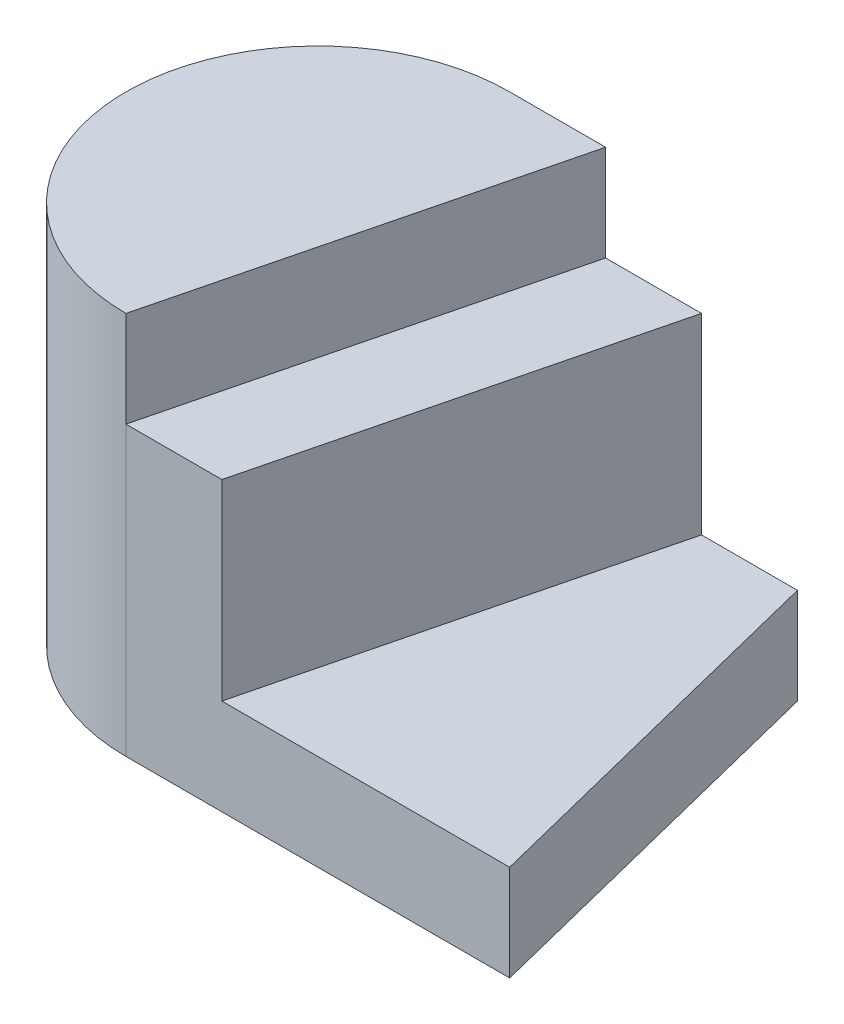
ISO-10303-21;
HEADER;
FILE_DESCRIPTION(('STEP AP214'),'2;1');
FILE_NAME('part.step','',(''),(''),'','','');
FILE_SCHEMA(('AUTOMOTIVE_DESIGN { 1 0 10303 214 1 1 1 1 }'));
ENDSEC;
DATA;
#1=APPLICATION_CONTEXT('core data for automotive mechanical design processes');
#2=APPLICATION_PROTOCOL_DEFINITION('international standard','automotive_design',2000,#1);
#3=PRODUCT_CONTEXT('',#1,'mechanical');
#4=PRODUCT('Part','Part','',(#3));
#5=PRODUCT_RELATED_PRODUCT_CATEGORY('part','',(#4));
#6=PRODUCT_DEFINITION_FORMATION('','',#4);
#7=PRODUCT_DEFINITION_CONTEXT('part definition',#1,'design');
#8=PRODUCT_DEFINITION('design','',#6,#7);
#9=PRODUCT_DEFINITION_SHAPE('','',#8);
#10=(LENGTH_UNIT() NAMED_UNIT(*) SI_UNIT(.MILLI.,.METRE.));
#11=(NAMED_UNIT(*) PLANE_ANGLE_UNIT() SI_UNIT($,.RADIAN.));
#12=(NAMED_UNIT(*) SI_UNIT($,.STERADIAN.) SOLID_ANGLE_UNIT());
#13=UNCERTAINTY_MEASURE_WITH_UNIT(LENGTH_MEASURE(1.E-05),#10,'distance_accuracy_value','');
#14=(GEOMETRIC_REPRESENTATION_CONTEXT(3) GLOBAL_UNCERTAINTY_ASSIGNED_CONTEXT((#13)) GLOBAL_UNIT_ASSIGNED_CONTEXT((#10,
#11,#12)) REPRESENTATION_CONTEXT('',''));
#15=CARTESIAN_POINT('',(0.,0.,0.));
#16=DIRECTION('',(0.,0.,1.));
#17=DIRECTION('',(1.,0.,0.));
#18=AXIS2_PLACEMENT_3D('',#15,#16,#17);
#19=CARTESIAN_POINT('',(0.470588235294118,4.,0.117647058823529));
#20=DIRECTION('',(-0.970142500145332,0.,-0.242535625036333));
#21=DIRECTION('',(-0.242535625036333,0.,0.970142500145332));
#22=AXIS2_PLACEMENT_3D('',#19,#20,#21);
#23=PLANE('',#22);
#24=DIRECTION('',(0.,-1.,0.));
#25=VECTOR('',#24,1.);
#26=CARTESIAN_POINT('',(0.,4.,2.));
#27=LINE('',#26,#25);
#28=CARTESIAN_POINT('',(0.,4.,2.));
#29=VERTEX_POINT('',#28);
#30=CARTESIAN_POINT('',(0.,3.,2.));
#31=VERTEX_POINT('',#30);
#32=EDGE_CURVE('E152',#29,#31,#27,.T.);
#33=ORIENTED_EDGE('',*,*,#32,.T.);
#34=DIRECTION('',(0.242535625036333,0.,-0.970142500145332));
#35=VECTOR('',#34,1.);
#36=CARTESIAN_POINT('',(0.470588235294118,3.,0.117647058823529));
#37=LINE('',#36,#35);
#38=CARTESIAN_POINT('',(1.,3.,-2.));
#39=VERTEX_POINT('',#38);
#40=EDGE_CURVE('E131',#31,#39,#37,.T.);
#41=ORIENTED_EDGE('',*,*,#40,.T.);
#42=DIRECTION('',(0.,-1.,0.));
#43=VECTOR('',#42,1.);
#44=CARTESIAN_POINT('',(1.,4.,-2.));
#45=LINE('',#44,#43);
#46=CARTESIAN_POINT('',(1.,4.,-2.));
#47=VERTEX_POINT('',#46);
#48=EDGE_CURVE('E11',#47,#39,#45,.T.);
#49=ORIENTED_EDGE('',*,*,#48,.F.);
#50=DIRECTION('',(0.242535625036333,0.,-0.970142500145332));
#51=VECTOR('',#50,1.);
#52=CARTESIAN_POINT('',(0.470588235294118,4.,0.117647058823529));
#53=LINE('',#52,#51);
#54=EDGE_CURVE('E144',#29,#47,#53,.T.);
#55=ORIENTED_EDGE('',*,*,#54,.F.);
#56=EDGE_LOOP('',(#33,#41,#49,#55));
#57=FACE_BOUND('',#56,.T.);
#58=ADVANCED_FACE('F37',(#57),#23,.F.);
#59=CARTESIAN_POINT('',(0.,4.,-2.));
#60=DIRECTION('',(0.,0.,-1.));
#61=DIRECTION('',(-1.,0.,0.));
#62=AXIS2_PLACEMENT_3D('',#59,#60,#61);
#63=PLANE('',#62);
#64=DIRECTION('',(1.,0.,0.));
#65=VECTOR('',#64,1.);
#66=CARTESIAN_POINT('',(0.,0.,-2.));
#67=LINE('',#66,#65);
#68=CARTESIAN_POINT('',(0.,0.,-2.));
#69=VERTEX_POINT('',#68);
#70=CARTESIAN_POINT('',(3.,0.,-2.));
#71=VERTEX_POINT('',#70);
#72=EDGE_CURVE('E143',#69,#71,#67,.T.);
#73=ORIENTED_EDGE('',*,*,#72,.F.);
#74=DIRECTION('',(0.,-1.,0.));
#75=VECTOR('',#74,1.);
#76=CARTESIAN_POINT('',(0.,4.,-2.));
#77=LINE('',#76,#75);
#78=CARTESIAN_POINT('',(0.,4.,-2.));
#79=VERTEX_POINT('',#78);
#80=EDGE_CURVE('E44',#79,#69,#77,.T.);
#81=ORIENTED_EDGE('',*,*,#80,.F.);
#82=DIRECTION('',(1.,0.,0.));
#83=VECTOR('',#82,1.);
#84=CARTESIAN_POINT('',(0.,4.,-2.));
#85=LINE('',#84,#83);
#86=EDGE_CURVE('E146',#79,#47,#85,.T.);
#87=ORIENTED_EDGE('',*,*,#86,.T.);
#88=ORIENTED_EDGE('',*,*,#48,.T.);
#89=DIRECTION('',(1.,0.,0.));
#90=VECTOR('',#89,1.);
#91=CARTESIAN_POINT('',(0.,3.,-2.));
#92=LINE('',#91,#90);
#93=CARTESIAN_POINT('',(2.,3.,-2.));
#94=VERTEX_POINT('',#93);
#95=EDGE_CURVE('E129',#39,#94,#92,.T.);
#96=ORIENTED_EDGE('',*,*,#95,.T.);
#97=DIRECTION('',(0.,-1.,0.));
#98=VECTOR('',#97,1.);
#99=CARTESIAN_POINT('',(2.,3.,-2.));
#100=LINE('',#99,#98);
#101=CARTESIAN_POINT('',(2.,1.,-2.));
#102=VERTEX_POINT('',#101);
#103=EDGE_CURVE('E120',#94,#102,#100,.T.);
#104=ORIENTED_EDGE('',*,*,#103,.T.);
#105=DIRECTION('',(1.,0.,0.));
#106=VECTOR('',#105,1.);
#107=CARTESIAN_POINT('',(0.,1.,-2.));
#108=LINE('',#107,#106);
#109=CARTESIAN_POINT('',(3.,1.,-2.));
#110=VERTEX_POINT('',#109);
#111=EDGE_CURVE('E114',#102,#110,#108,.T.);
#112=ORIENTED_EDGE('',*,*,#111,.T.);
#113=DIRECTION('',(0.,-1.,0.));
#114=VECTOR('',#113,1.);
#115=CARTESIAN_POINT('',(3.,1.,-2.));
#116=LINE('',#115,#114);
#117=EDGE_CURVE('E97',#110,#71,#116,.T.);
#118=ORIENTED_EDGE('',*,*,#117,.T.);
#119=EDGE_LOOP('',(#73,#81,#87,#88,#96,#104,#112,#118));
#120=FACE_BOUND('',#119,.T.);
#121=ADVANCED_FACE('F118',(#120),#63,.T.);
#122=CARTESIAN_POINT('',(0.,4.,0.));
#123=DIRECTION('',(0.,-1.,0.));
#124=DIRECTION('',(0.,0.,-1.));
#125=AXIS2_PLACEMENT_3D('',#122,#123,#124);
#126=CYLINDRICAL_SURFACE('',#125,2.);
#127=CARTESIAN_POINT('',(0.,0.,0.));
#128=DIRECTION('',(0.,1.,0.));
#129=DIRECTION('',(0.,0.,1.));
#130=AXIS2_PLACEMENT_3D('',#127,#128,#129);
#131=CIRCLE('',#130,2.);
#132=CARTESIAN_POINT('',(0.,0.,2.));
#133=VERTEX_POINT('',#132);
#134=EDGE_CURVE('E147',#69,#133,#131,.T.);
#135=ORIENTED_EDGE('',*,*,#134,.T.);
#136=DIRECTION('',(0.,-1.,0.));
#137=VECTOR('',#136,1.);
#138=CARTESIAN_POINT('',(0.,3.,2.));
#139=LINE('',#138,#137);
#140=EDGE_CURVE('E139',#31,#133,#139,.T.);
#141=ORIENTED_EDGE('',*,*,#140,.F.);
#142=ORIENTED_EDGE('',*,*,#32,.F.);
#143=CARTESIAN_POINT('',(0.,4.,0.));
#144=DIRECTION('',(0.,1.,0.));
#145=DIRECTION('',(0.,0.,1.));
#146=AXIS2_PLACEMENT_3D('',#143,#144,#145);
#147=CIRCLE('',#146,2.);
#148=EDGE_CURVE('E150',#79,#29,#147,.T.);
#149=ORIENTED_EDGE('',*,*,#148,.F.);
#150=ORIENTED_EDGE('',*,*,#80,.T.);
#151=EDGE_LOOP('',(#135,#141,#142,#149,#150));
#152=FACE_BOUND('',#151,.T.);
#153=ADVANCED_FACE('F159',(#152),#126,.T.);
#154=CARTESIAN_POINT('',(0.,4.,0.));
#155=DIRECTION('',(0.,1.,0.));
#156=DIRECTION('',(0.,0.,1.));
#157=AXIS2_PLACEMENT_3D('',#154,#155,#156);
#158=PLANE('',#157);
#159=ORIENTED_EDGE('',*,*,#54,.T.);
#160=ORIENTED_EDGE('',*,*,#86,.F.);
#161=ORIENTED_EDGE('',*,*,#148,.T.);
#162=EDGE_LOOP('',(#159,#160,#161));
#163=FACE_BOUND('',#162,.T.);
#164=ADVANCED_FACE('F176',(#163),#158,.T.);
#165=CARTESIAN_POINT('',(0.,0.,0.));
#166=DIRECTION('',(0.,1.,0.));
#167=DIRECTION('',(0.,0.,1.));
#168=AXIS2_PLACEMENT_3D('',#165,#166,#167);
#169=PLANE('',#168);
#170=ORIENTED_EDGE('',*,*,#72,.T.);
#171=DIRECTION('',(0.242535625036333,0.,0.970142500145332));
#172=VECTOR('',#171,1.);
#173=CARTESIAN_POINT('',(3.29411764705882,0.,-0.823529411764706));
#174=LINE('',#173,#172);
#175=CARTESIAN_POINT('',(4.,0.,2.));
#176=VERTEX_POINT('',#175);
#177=EDGE_CURVE('E104',#71,#176,#174,.T.);
#178=ORIENTED_EDGE('',*,*,#177,.T.);
#179=DIRECTION('',(-1.,0.,0.));
#180=VECTOR('',#179,1.);
#181=CARTESIAN_POINT('',(0.,0.,2.));
#182=LINE('',#181,#180);
#183=EDGE_CURVE('E108',#176,#133,#182,.T.);
#184=ORIENTED_EDGE('',*,*,#183,.T.);
#185=ORIENTED_EDGE('',*,*,#134,.F.);
#186=EDGE_LOOP('',(#170,#178,#184,#185));
#187=FACE_BOUND('',#186,.T.);
#188=ADVANCED_FACE('F163',(#187),#169,.F.);
#189=CARTESIAN_POINT('',(1.41176470588235,3.,0.352941176470588));
#190=DIRECTION('',(0.970142500145332,0.,0.242535625036333));
#191=DIRECTION('',(0.242535625036333,0.,-0.970142500145332));
#192=AXIS2_PLACEMENT_3D('',#189,#190,#191);
#193=PLANE('',#192);
#194=DIRECTION('',(-0.242535625036333,0.,0.970142500145332));
#195=VECTOR('',#194,1.);
#196=CARTESIAN_POINT('',(1.41176470588235,1.,0.352941176470588));
#197=LINE('',#196,#195);
#198=CARTESIAN_POINT('',(1.,1.,2.));
#199=VERTEX_POINT('',#198);
#200=EDGE_CURVE('E51',#102,#199,#197,.T.);
#201=ORIENTED_EDGE('',*,*,#200,.F.);
#202=ORIENTED_EDGE('',*,*,#103,.F.);
#203=DIRECTION('',(-0.242535625036333,0.,0.970142500145332));
#204=VECTOR('',#203,1.);
#205=CARTESIAN_POINT('',(1.41176470588235,3.,0.352941176470588));
#206=LINE('',#205,#204);
#207=CARTESIAN_POINT('',(1.,3.,2.));
#208=VERTEX_POINT('',#207);
#209=EDGE_CURVE('E127',#94,#208,#206,.T.);
#210=ORIENTED_EDGE('',*,*,#209,.T.);
#211=DIRECTION('',(0.,-1.,0.));
#212=VECTOR('',#211,1.);
#213=CARTESIAN_POINT('',(1.,3.,2.));
#214=LINE('',#213,#212);
#215=EDGE_CURVE('E56',#208,#199,#214,.T.);
#216=ORIENTED_EDGE('',*,*,#215,.T.);
#217=EDGE_LOOP('',(#201,#202,#210,#216));
#218=FACE_BOUND('',#217,.T.);
#219=ADVANCED_FACE('F183',(#218),#193,.T.);
#220=CARTESIAN_POINT('',(0.,3.,2.));
#221=DIRECTION('',(0.,0.,1.));
#222=DIRECTION('',(1.,0.,0.));
#223=AXIS2_PLACEMENT_3D('',#220,#221,#222);
#224=PLANE('',#223);
#225=ORIENTED_EDGE('',*,*,#183,.F.);
#226=DIRECTION('',(0.,-1.,0.));
#227=VECTOR('',#226,1.);
#228=CARTESIAN_POINT('',(4.,1.,2.));
#229=LINE('',#228,#227);
#230=CARTESIAN_POINT('',(4.,1.,2.));
#231=VERTEX_POINT('',#230);
#232=EDGE_CURVE('E109',#231,#176,#229,.T.);
#233=ORIENTED_EDGE('',*,*,#232,.F.);
#234=DIRECTION('',(-1.,0.,0.));
#235=VECTOR('',#234,1.);
#236=CARTESIAN_POINT('',(0.,1.,2.));
#237=LINE('',#236,#235);
#238=EDGE_CURVE('E116',#231,#199,#237,.T.);
#239=ORIENTED_EDGE('',*,*,#238,.T.);
#240=ORIENTED_EDGE('',*,*,#215,.F.);
#241=DIRECTION('',(-1.,0.,0.));
#242=VECTOR('',#241,1.);
#243=CARTESIAN_POINT('',(0.,3.,2.));
#244=LINE('',#243,#242);
#245=EDGE_CURVE('E133',#208,#31,#244,.T.);
#246=ORIENTED_EDGE('',*,*,#245,.T.);
#247=ORIENTED_EDGE('',*,*,#140,.T.);
#248=EDGE_LOOP('',(#225,#233,#239,#240,#246,#247));
#249=FACE_BOUND('',#248,.T.);
#250=ADVANCED_FACE('F165',(#249),#224,.T.);
#251=CARTESIAN_POINT('',(0.,3.,0.));
#252=DIRECTION('',(0.,1.,0.));
#253=DIRECTION('',(0.,0.,1.));
#254=AXIS2_PLACEMENT_3D('',#251,#252,#253);
#255=PLANE('',#254);
#256=ORIENTED_EDGE('',*,*,#209,.F.);
#257=ORIENTED_EDGE('',*,*,#95,.F.);
#258=ORIENTED_EDGE('',*,*,#40,.F.);
#259=ORIENTED_EDGE('',*,*,#245,.F.);
#260=EDGE_LOOP('',(#256,#257,#258,#259));
#261=FACE_BOUND('',#260,.T.);
#262=ADVANCED_FACE('F174',(#261),#255,.T.);
#263=CARTESIAN_POINT('',(3.29411764705882,1.,-0.823529411764706));
#264=DIRECTION('',(0.970142500145332,0.,-0.242535625036333));
#265=DIRECTION('',(-0.242535625036333,0.,-0.970142500145332));
#266=AXIS2_PLACEMENT_3D('',#263,#264,#265);
#267=PLANE('',#266);
#268=ORIENTED_EDGE('',*,*,#177,.F.);
#269=ORIENTED_EDGE('',*,*,#117,.F.);
#270=DIRECTION('',(0.242535625036333,0.,0.970142500145332));
#271=VECTOR('',#270,1.);
#272=CARTESIAN_POINT('',(3.29411764705882,1.,-0.823529411764706));
#273=LINE('',#272,#271);
#274=EDGE_CURVE('E101',#110,#231,#273,.T.);
#275=ORIENTED_EDGE('',*,*,#274,.T.);
#276=ORIENTED_EDGE('',*,*,#232,.T.);
#277=EDGE_LOOP('',(#268,#269,#275,#276));
#278=FACE_BOUND('',#277,.T.);
#279=ADVANCED_FACE('F99',(#278),#267,.T.);
#280=CARTESIAN_POINT('',(0.,1.,0.));
#281=DIRECTION('',(0.,1.,0.));
#282=DIRECTION('',(0.,0.,1.));
#283=AXIS2_PLACEMENT_3D('',#280,#281,#282);
#284=PLANE('',#283);
#285=ORIENTED_EDGE('',*,*,#274,.F.);
#286=ORIENTED_EDGE('',*,*,#111,.F.);
#287=ORIENTED_EDGE('',*,*,#200,.T.);
#288=ORIENTED_EDGE('',*,*,#238,.F.);
#289=EDGE_LOOP('',(#285,#286,#287,#288));
#290=FACE_BOUND('',#289,.T.);
#291=ADVANCED_FACE('F113',(#290),#284,.T.);
#292=CLOSED_SHELL('',(#58,#121,#153,#164,#188,#219,#250,#262,#279,#291));
#293=MANIFOLD_SOLID_BREP('B2',#292);
#294=ADVANCED_BREP_SHAPE_REPRESENTATION('',(#18,#293),#14);
#295=SHAPE_DEFINITION_REPRESENTATION(#9,#294);
ENDSEC;
END-ISO-10303-21;
